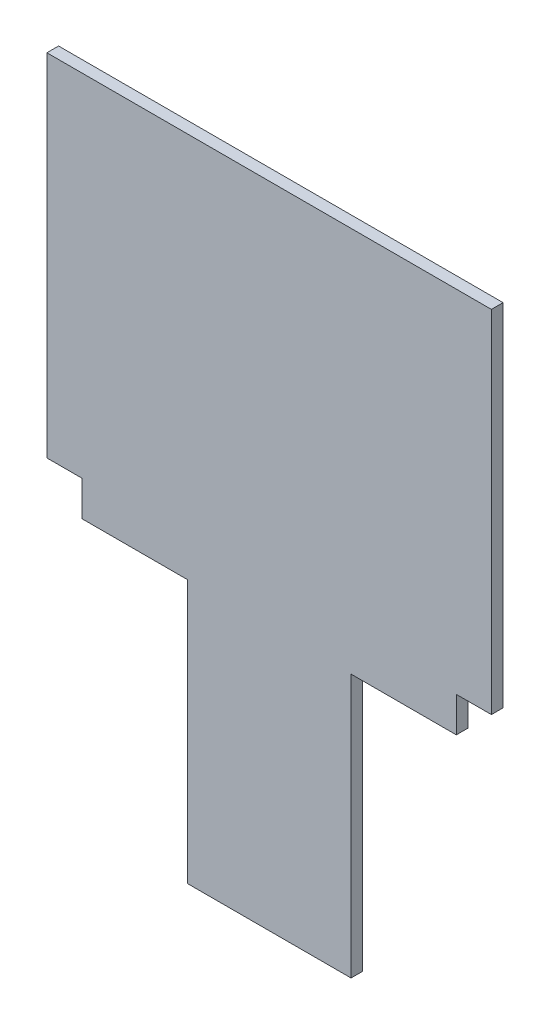
ISO-10303-21;
HEADER;
FILE_DESCRIPTION(('STEP AP214'),'2;1');
FILE_NAME('part.step','',(''),(''),'','','');
FILE_SCHEMA(('AUTOMOTIVE_DESIGN { 1 0 10303 214 1 1 1 1 }'));
ENDSEC;
DATA;
#1=APPLICATION_CONTEXT('core data for automotive mechanical design processes');
#2=APPLICATION_PROTOCOL_DEFINITION('international standard','automotive_design',2000,#1);
#3=PRODUCT_CONTEXT('',#1,'mechanical');
#4=PRODUCT('Part','Part','',(#3));
#5=PRODUCT_RELATED_PRODUCT_CATEGORY('part','',(#4));
#6=PRODUCT_DEFINITION_FORMATION('','',#4);
#7=PRODUCT_DEFINITION_CONTEXT('part definition',#1,'design');
#8=PRODUCT_DEFINITION('design','',#6,#7);
#9=PRODUCT_DEFINITION_SHAPE('','',#8);
#10=(LENGTH_UNIT() NAMED_UNIT(*) SI_UNIT(.MILLI.,.METRE.));
#11=(NAMED_UNIT(*) PLANE_ANGLE_UNIT() SI_UNIT($,.RADIAN.));
#12=(NAMED_UNIT(*) SI_UNIT($,.STERADIAN.) SOLID_ANGLE_UNIT());
#13=UNCERTAINTY_MEASURE_WITH_UNIT(LENGTH_MEASURE(1.E-05),#10,'distance_accuracy_value','');
#14=(GEOMETRIC_REPRESENTATION_CONTEXT(3) GLOBAL_UNCERTAINTY_ASSIGNED_CONTEXT((#13)) GLOBAL_UNIT_ASSIGNED_CONTEXT((#10,
#11,#12)) REPRESENTATION_CONTEXT('',''));
#15=CARTESIAN_POINT('',(0.,0.,0.));
#16=DIRECTION('',(0.,0.,1.));
#17=DIRECTION('',(1.,0.,0.));
#18=AXIS2_PLACEMENT_3D('',#15,#16,#17);
#19=CARTESIAN_POINT('',(14.,-113.,-2.));
#20=DIRECTION('',(0.,-1.,0.));
#21=DIRECTION('',(0.,0.,-1.));
#22=AXIS2_PLACEMENT_3D('',#19,#20,#21);
#23=PLANE('',#22);
#24=DIRECTION('',(1.,0.,0.));
#25=VECTOR('',#24,1.);
#26=CARTESIAN_POINT('',(14.,-113.,0.));
#27=LINE('',#26,#25);
#28=CARTESIAN_POINT('',(-14.,-113.,0.));
#29=VERTEX_POINT('',#28);
#30=CARTESIAN_POINT('',(14.,-113.,0.));
#31=VERTEX_POINT('',#30);
#32=EDGE_CURVE('E156',#29,#31,#27,.T.);
#33=ORIENTED_EDGE('',*,*,#32,.F.);
#34=DIRECTION('',(0.,0.,1.));
#35=VECTOR('',#34,1.);
#36=CARTESIAN_POINT('',(-14.,-113.,-2.));
#37=LINE('',#36,#35);
#38=CARTESIAN_POINT('',(-14.,-113.,-2.));
#39=VERTEX_POINT('',#38);
#40=EDGE_CURVE('E11',#39,#29,#37,.T.);
#41=ORIENTED_EDGE('',*,*,#40,.F.);
#42=DIRECTION('',(1.,0.,0.));
#43=VECTOR('',#42,1.);
#44=CARTESIAN_POINT('',(14.,-113.,-2.));
#45=LINE('',#44,#43);
#46=CARTESIAN_POINT('',(14.,-113.,-2.));
#47=VERTEX_POINT('',#46);
#48=EDGE_CURVE('E188',#39,#47,#45,.T.);
#49=ORIENTED_EDGE('',*,*,#48,.T.);
#50=DIRECTION('',(0.,0.,1.));
#51=VECTOR('',#50,1.);
#52=CARTESIAN_POINT('',(14.,-113.,-2.));
#53=LINE('',#52,#51);
#54=EDGE_CURVE('E38',#47,#31,#53,.T.);
#55=ORIENTED_EDGE('',*,*,#54,.T.);
#56=EDGE_LOOP('',(#33,#41,#49,#55));
#57=FACE_BOUND('',#56,.T.);
#58=ADVANCED_FACE('F35',(#57),#23,.T.);
#59=CARTESIAN_POINT('',(-14.,-68.,-2.));
#60=DIRECTION('',(-1.,0.,0.));
#61=DIRECTION('',(0.,0.,1.));
#62=AXIS2_PLACEMENT_3D('',#59,#60,#61);
#63=PLANE('',#62);
#64=DIRECTION('',(0.,-1.,0.));
#65=VECTOR('',#64,1.);
#66=CARTESIAN_POINT('',(-14.,-68.,0.));
#67=LINE('',#66,#65);
#68=CARTESIAN_POINT('',(-14.,-68.,0.));
#69=VERTEX_POINT('',#68);
#70=EDGE_CURVE('E186',#69,#29,#67,.T.);
#71=ORIENTED_EDGE('',*,*,#70,.F.);
#72=DIRECTION('',(0.,0.,1.));
#73=VECTOR('',#72,1.);
#74=CARTESIAN_POINT('',(-14.,-68.,-2.));
#75=LINE('',#74,#73);
#76=CARTESIAN_POINT('',(-14.,-68.,-2.));
#77=VERTEX_POINT('',#76);
#78=EDGE_CURVE('E44',#77,#69,#75,.T.);
#79=ORIENTED_EDGE('',*,*,#78,.F.);
#80=DIRECTION('',(0.,-1.,0.));
#81=VECTOR('',#80,1.);
#82=CARTESIAN_POINT('',(-14.,-68.,-2.));
#83=LINE('',#82,#81);
#84=EDGE_CURVE('E146',#77,#39,#83,.T.);
#85=ORIENTED_EDGE('',*,*,#84,.T.);
#86=ORIENTED_EDGE('',*,*,#40,.T.);
#87=EDGE_LOOP('',(#71,#79,#85,#86));
#88=FACE_BOUND('',#87,.T.);
#89=ADVANCED_FACE('F208',(#88),#63,.T.);
#90=CARTESIAN_POINT('',(-32.,-68.,-2.));
#91=DIRECTION('',(0.,-1.,0.));
#92=DIRECTION('',(0.,0.,-1.));
#93=AXIS2_PLACEMENT_3D('',#90,#91,#92);
#94=PLANE('',#93);
#95=DIRECTION('',(1.,0.,0.));
#96=VECTOR('',#95,1.);
#97=CARTESIAN_POINT('',(-32.,-68.,0.));
#98=LINE('',#97,#96);
#99=CARTESIAN_POINT('',(-32.,-68.,0.));
#100=VERTEX_POINT('',#99);
#101=EDGE_CURVE('E133',#100,#69,#98,.T.);
#102=ORIENTED_EDGE('',*,*,#101,.F.);
#103=DIRECTION('',(0.,0.,1.));
#104=VECTOR('',#103,1.);
#105=CARTESIAN_POINT('',(-32.,-68.,-2.));
#106=LINE('',#105,#104);
#107=CARTESIAN_POINT('',(-32.,-68.,-2.));
#108=VERTEX_POINT('',#107);
#109=EDGE_CURVE('E128',#108,#100,#106,.T.);
#110=ORIENTED_EDGE('',*,*,#109,.F.);
#111=DIRECTION('',(1.,0.,0.));
#112=VECTOR('',#111,1.);
#113=CARTESIAN_POINT('',(-32.,-68.,-2.));
#114=LINE('',#113,#112);
#115=EDGE_CURVE('E131',#108,#77,#114,.T.);
#116=ORIENTED_EDGE('',*,*,#115,.T.);
#117=ORIENTED_EDGE('',*,*,#78,.T.);
#118=EDGE_LOOP('',(#102,#110,#116,#117));
#119=FACE_BOUND('',#118,.T.);
#120=ADVANCED_FACE('F130',(#119),#94,.T.);
#121=CARTESIAN_POINT('',(-32.,-68.,-2.));
#122=DIRECTION('',(-1.,0.,0.));
#123=DIRECTION('',(0.,0.,1.));
#124=AXIS2_PLACEMENT_3D('',#121,#122,#123);
#125=PLANE('',#124);
#126=DIRECTION('',(0.,-1.,0.));
#127=VECTOR('',#126,1.);
#128=CARTESIAN_POINT('',(-32.,-68.,0.));
#129=LINE('',#128,#127);
#130=CARTESIAN_POINT('',(-32.,-62.,0.));
#131=VERTEX_POINT('',#130);
#132=EDGE_CURVE('E183',#131,#100,#129,.T.);
#133=ORIENTED_EDGE('',*,*,#132,.F.);
#134=DIRECTION('',(0.,0.,1.));
#135=VECTOR('',#134,1.);
#136=CARTESIAN_POINT('',(-32.,-62.,-2.));
#137=LINE('',#136,#135);
#138=CARTESIAN_POINT('',(-32.,-62.,-2.));
#139=VERTEX_POINT('',#138);
#140=EDGE_CURVE('E138',#139,#131,#137,.T.);
#141=ORIENTED_EDGE('',*,*,#140,.F.);
#142=DIRECTION('',(0.,-1.,0.));
#143=VECTOR('',#142,1.);
#144=CARTESIAN_POINT('',(-32.,-68.,-2.));
#145=LINE('',#144,#143);
#146=EDGE_CURVE('E144',#139,#108,#145,.T.);
#147=ORIENTED_EDGE('',*,*,#146,.T.);
#148=ORIENTED_EDGE('',*,*,#109,.T.);
#149=EDGE_LOOP('',(#133,#141,#147,#148));
#150=FACE_BOUND('',#149,.T.);
#151=ADVANCED_FACE('F148',(#150),#125,.T.);
#152=CARTESIAN_POINT('',(-32.,-62.,-2.));
#153=DIRECTION('',(0.,-1.,0.));
#154=DIRECTION('',(0.,0.,-1.));
#155=AXIS2_PLACEMENT_3D('',#152,#153,#154);
#156=PLANE('',#155);
#157=DIRECTION('',(1.,0.,0.));
#158=VECTOR('',#157,1.);
#159=CARTESIAN_POINT('',(-32.,-62.,0.));
#160=LINE('',#159,#158);
#161=CARTESIAN_POINT('',(-38.,-62.,0.));
#162=VERTEX_POINT('',#161);
#163=EDGE_CURVE('E180',#162,#131,#160,.T.);
#164=ORIENTED_EDGE('',*,*,#163,.F.);
#165=DIRECTION('',(0.,0.,1.));
#166=VECTOR('',#165,1.);
#167=CARTESIAN_POINT('',(-38.,-62.,-2.));
#168=LINE('',#167,#166);
#169=CARTESIAN_POINT('',(-38.,-62.,-2.));
#170=VERTEX_POINT('',#169);
#171=EDGE_CURVE('E192',#170,#162,#168,.T.);
#172=ORIENTED_EDGE('',*,*,#171,.F.);
#173=DIRECTION('',(1.,0.,0.));
#174=VECTOR('',#173,1.);
#175=CARTESIAN_POINT('',(-32.,-62.,-2.));
#176=LINE('',#175,#174);
#177=EDGE_CURVE('E149',#170,#139,#176,.T.);
#178=ORIENTED_EDGE('',*,*,#177,.T.);
#179=ORIENTED_EDGE('',*,*,#140,.T.);
#180=EDGE_LOOP('',(#164,#172,#178,#179));
#181=FACE_BOUND('',#180,.T.);
#182=ADVANCED_FACE('F221',(#181),#156,.T.);
#183=CARTESIAN_POINT('',(-38.,-2.,-2.));
#184=DIRECTION('',(-1.,0.,0.));
#185=DIRECTION('',(0.,0.,1.));
#186=AXIS2_PLACEMENT_3D('',#183,#184,#185);
#187=PLANE('',#186);
#188=DIRECTION('',(0.,-1.,0.));
#189=VECTOR('',#188,1.);
#190=CARTESIAN_POINT('',(-38.,-2.,0.));
#191=LINE('',#190,#189);
#192=CARTESIAN_POINT('',(-38.,-2.,0.));
#193=VERTEX_POINT('',#192);
#194=EDGE_CURVE('E177',#193,#162,#191,.T.);
#195=ORIENTED_EDGE('',*,*,#194,.F.);
#196=DIRECTION('',(0.,0.,1.));
#197=VECTOR('',#196,1.);
#198=CARTESIAN_POINT('',(-38.,-2.,-2.));
#199=LINE('',#198,#197);
#200=CARTESIAN_POINT('',(-38.,-2.,-2.));
#201=VERTEX_POINT('',#200);
#202=EDGE_CURVE('E194',#201,#193,#199,.T.);
#203=ORIENTED_EDGE('',*,*,#202,.F.);
#204=DIRECTION('',(0.,-1.,0.));
#205=VECTOR('',#204,1.);
#206=CARTESIAN_POINT('',(-38.,-2.,-2.));
#207=LINE('',#206,#205);
#208=EDGE_CURVE('E151',#201,#170,#207,.T.);
#209=ORIENTED_EDGE('',*,*,#208,.T.);
#210=ORIENTED_EDGE('',*,*,#171,.T.);
#211=EDGE_LOOP('',(#195,#203,#209,#210));
#212=FACE_BOUND('',#211,.T.);
#213=ADVANCED_FACE('F224',(#212),#187,.T.);
#214=CARTESIAN_POINT('',(38.,-2.,-2.));
#215=DIRECTION('',(0.,1.,0.));
#216=DIRECTION('',(0.,0.,1.));
#217=AXIS2_PLACEMENT_3D('',#214,#215,#216);
#218=PLANE('',#217);
#219=DIRECTION('',(-1.,0.,0.));
#220=VECTOR('',#219,1.);
#221=CARTESIAN_POINT('',(38.,-2.,0.));
#222=LINE('',#221,#220);
#223=CARTESIAN_POINT('',(38.,-2.,0.));
#224=VERTEX_POINT('',#223);
#225=EDGE_CURVE('E174',#224,#193,#222,.T.);
#226=ORIENTED_EDGE('',*,*,#225,.F.);
#227=DIRECTION('',(0.,0.,1.));
#228=VECTOR('',#227,1.);
#229=CARTESIAN_POINT('',(38.,-2.,-2.));
#230=LINE('',#229,#228);
#231=CARTESIAN_POINT('',(38.,-2.,-2.));
#232=VERTEX_POINT('',#231);
#233=EDGE_CURVE('E196',#232,#224,#230,.T.);
#234=ORIENTED_EDGE('',*,*,#233,.F.);
#235=DIRECTION('',(-1.,0.,0.));
#236=VECTOR('',#235,1.);
#237=CARTESIAN_POINT('',(38.,-2.,-2.));
#238=LINE('',#237,#236);
#239=EDGE_CURVE('E350',#232,#201,#238,.T.);
#240=ORIENTED_EDGE('',*,*,#239,.T.);
#241=ORIENTED_EDGE('',*,*,#202,.T.);
#242=EDGE_LOOP('',(#226,#234,#240,#241));
#243=FACE_BOUND('',#242,.T.);
#244=ADVANCED_FACE('F228',(#243),#218,.T.);
#245=CARTESIAN_POINT('',(38.,-62.,-2.));
#246=DIRECTION('',(1.,0.,0.));
#247=DIRECTION('',(0.,0.,-1.));
#248=AXIS2_PLACEMENT_3D('',#245,#246,#247);
#249=PLANE('',#248);
#250=DIRECTION('',(0.,1.,0.));
#251=VECTOR('',#250,1.);
#252=CARTESIAN_POINT('',(38.,-62.,0.));
#253=LINE('',#252,#251);
#254=CARTESIAN_POINT('',(38.,-62.,0.));
#255=VERTEX_POINT('',#254);
#256=EDGE_CURVE('E171',#255,#224,#253,.T.);
#257=ORIENTED_EDGE('',*,*,#256,.F.);
#258=DIRECTION('',(0.,0.,1.));
#259=VECTOR('',#258,1.);
#260=CARTESIAN_POINT('',(38.,-62.,-2.));
#261=LINE('',#260,#259);
#262=CARTESIAN_POINT('',(38.,-62.,-2.));
#263=VERTEX_POINT('',#262);
#264=EDGE_CURVE('E198',#263,#255,#261,.T.);
#265=ORIENTED_EDGE('',*,*,#264,.F.);
#266=DIRECTION('',(0.,1.,0.));
#267=VECTOR('',#266,1.);
#268=CARTESIAN_POINT('',(38.,-62.,-2.));
#269=LINE('',#268,#267);
#270=EDGE_CURVE('E354',#263,#232,#269,.T.);
#271=ORIENTED_EDGE('',*,*,#270,.T.);
#272=ORIENTED_EDGE('',*,*,#233,.T.);
#273=EDGE_LOOP('',(#257,#265,#271,#272));
#274=FACE_BOUND('',#273,.T.);
#275=ADVANCED_FACE('F232',(#274),#249,.T.);
#276=CARTESIAN_POINT('',(38.,-62.,-2.));
#277=DIRECTION('',(0.,-1.,0.));
#278=DIRECTION('',(0.,0.,-1.));
#279=AXIS2_PLACEMENT_3D('',#276,#277,#278);
#280=PLANE('',#279);
#281=DIRECTION('',(1.,0.,0.));
#282=VECTOR('',#281,1.);
#283=CARTESIAN_POINT('',(38.,-62.,0.));
#284=LINE('',#283,#282);
#285=CARTESIAN_POINT('',(32.,-62.,0.));
#286=VERTEX_POINT('',#285);
#287=EDGE_CURVE('E168',#286,#255,#284,.T.);
#288=ORIENTED_EDGE('',*,*,#287,.F.);
#289=DIRECTION('',(0.,0.,1.));
#290=VECTOR('',#289,1.);
#291=CARTESIAN_POINT('',(32.,-62.,-2.));
#292=LINE('',#291,#290);
#293=CARTESIAN_POINT('',(32.,-62.,-2.));
#294=VERTEX_POINT('',#293);
#295=EDGE_CURVE('E200',#294,#286,#292,.T.);
#296=ORIENTED_EDGE('',*,*,#295,.F.);
#297=DIRECTION('',(1.,0.,0.));
#298=VECTOR('',#297,1.);
#299=CARTESIAN_POINT('',(38.,-62.,-2.));
#300=LINE('',#299,#298);
#301=EDGE_CURVE('E343',#294,#263,#300,.T.);
#302=ORIENTED_EDGE('',*,*,#301,.T.);
#303=ORIENTED_EDGE('',*,*,#264,.T.);
#304=EDGE_LOOP('',(#288,#296,#302,#303));
#305=FACE_BOUND('',#304,.T.);
#306=ADVANCED_FACE('F236',(#305),#280,.T.);
#307=CARTESIAN_POINT('',(32.,-62.,-2.));
#308=DIRECTION('',(1.,0.,0.));
#309=DIRECTION('',(0.,0.,-1.));
#310=AXIS2_PLACEMENT_3D('',#307,#308,#309);
#311=PLANE('',#310);
#312=DIRECTION('',(0.,1.,0.));
#313=VECTOR('',#312,1.);
#314=CARTESIAN_POINT('',(32.,-62.,0.));
#315=LINE('',#314,#313);
#316=CARTESIAN_POINT('',(32.,-68.,0.));
#317=VERTEX_POINT('',#316);
#318=EDGE_CURVE('E165',#317,#286,#315,.T.);
#319=ORIENTED_EDGE('',*,*,#318,.F.);
#320=DIRECTION('',(0.,0.,1.));
#321=VECTOR('',#320,1.);
#322=CARTESIAN_POINT('',(32.,-68.,-2.));
#323=LINE('',#322,#321);
#324=CARTESIAN_POINT('',(32.,-68.,-2.));
#325=VERTEX_POINT('',#324);
#326=EDGE_CURVE('E202',#325,#317,#323,.T.);
#327=ORIENTED_EDGE('',*,*,#326,.F.);
#328=DIRECTION('',(0.,1.,0.));
#329=VECTOR('',#328,1.);
#330=CARTESIAN_POINT('',(32.,-62.,-2.));
#331=LINE('',#330,#329);
#332=EDGE_CURVE('E339',#325,#294,#331,.T.);
#333=ORIENTED_EDGE('',*,*,#332,.T.);
#334=ORIENTED_EDGE('',*,*,#295,.T.);
#335=EDGE_LOOP('',(#319,#327,#333,#334));
#336=FACE_BOUND('',#335,.T.);
#337=ADVANCED_FACE('F240',(#336),#311,.T.);
#338=CARTESIAN_POINT('',(14.,-68.,-2.));
#339=DIRECTION('',(0.,-1.,0.));
#340=DIRECTION('',(0.,0.,-1.));
#341=AXIS2_PLACEMENT_3D('',#338,#339,#340);
#342=PLANE('',#341);
#343=DIRECTION('',(1.,0.,0.));
#344=VECTOR('',#343,1.);
#345=CARTESIAN_POINT('',(14.,-68.,0.));
#346=LINE('',#345,#344);
#347=CARTESIAN_POINT('',(14.,-68.,0.));
#348=VERTEX_POINT('',#347);
#349=EDGE_CURVE('E162',#348,#317,#346,.T.);
#350=ORIENTED_EDGE('',*,*,#349,.F.);
#351=DIRECTION('',(0.,0.,1.));
#352=VECTOR('',#351,1.);
#353=CARTESIAN_POINT('',(14.,-68.,-2.));
#354=LINE('',#353,#352);
#355=CARTESIAN_POINT('',(14.,-68.,-2.));
#356=VERTEX_POINT('',#355);
#357=EDGE_CURVE('E203',#356,#348,#354,.T.);
#358=ORIENTED_EDGE('',*,*,#357,.F.);
#359=DIRECTION('',(1.,0.,0.));
#360=VECTOR('',#359,1.);
#361=CARTESIAN_POINT('',(14.,-68.,-2.));
#362=LINE('',#361,#360);
#363=EDGE_CURVE('E360',#356,#325,#362,.T.);
#364=ORIENTED_EDGE('',*,*,#363,.T.);
#365=ORIENTED_EDGE('',*,*,#326,.T.);
#366=EDGE_LOOP('',(#350,#358,#364,#365));
#367=FACE_BOUND('',#366,.T.);
#368=ADVANCED_FACE('F244',(#367),#342,.T.);
#369=CARTESIAN_POINT('',(14.,-113.,-2.));
#370=DIRECTION('',(1.,0.,0.));
#371=DIRECTION('',(0.,1.,0.));
#372=AXIS2_PLACEMENT_3D('',#369,#370,#371);
#373=PLANE('',#372);
#374=DIRECTION('',(0.,1.,0.));
#375=VECTOR('',#374,1.);
#376=CARTESIAN_POINT('',(14.,-113.,0.));
#377=LINE('',#376,#375);
#378=EDGE_CURVE('E159',#31,#348,#377,.T.);
#379=ORIENTED_EDGE('',*,*,#378,.F.);
#380=ORIENTED_EDGE('',*,*,#54,.F.);
#381=DIRECTION('',(0.,1.,0.));
#382=VECTOR('',#381,1.);
#383=CARTESIAN_POINT('',(14.,-113.,-2.));
#384=LINE('',#383,#382);
#385=EDGE_CURVE('E362',#47,#356,#384,.T.);
#386=ORIENTED_EDGE('',*,*,#385,.T.);
#387=ORIENTED_EDGE('',*,*,#357,.T.);
#388=EDGE_LOOP('',(#379,#380,#386,#387));
#389=FACE_BOUND('',#388,.T.);
#390=ADVANCED_FACE('F205',(#389),#373,.T.);
#391=CARTESIAN_POINT('',(0.,0.,-2.));
#392=DIRECTION('',(0.,0.,1.));
#393=DIRECTION('',(1.,0.,0.));
#394=AXIS2_PLACEMENT_3D('',#391,#392,#393);
#395=PLANE('',#394);
#396=ORIENTED_EDGE('',*,*,#48,.F.);
#397=ORIENTED_EDGE('',*,*,#84,.F.);
#398=ORIENTED_EDGE('',*,*,#115,.F.);
#399=ORIENTED_EDGE('',*,*,#146,.F.);
#400=ORIENTED_EDGE('',*,*,#177,.F.);
#401=ORIENTED_EDGE('',*,*,#208,.F.);
#402=ORIENTED_EDGE('',*,*,#239,.F.);
#403=ORIENTED_EDGE('',*,*,#270,.F.);
#404=ORIENTED_EDGE('',*,*,#301,.F.);
#405=ORIENTED_EDGE('',*,*,#332,.F.);
#406=ORIENTED_EDGE('',*,*,#363,.F.);
#407=ORIENTED_EDGE('',*,*,#385,.F.);
#408=EDGE_LOOP('',(#396,#397,#398,#399,#400,#401,#402,#403,#404,#405,#406,#407));
#409=FACE_BOUND('',#408,.T.);
#410=ADVANCED_FACE('F142',(#409),#395,.F.);
#411=CARTESIAN_POINT('',(0.,0.,0.));
#412=DIRECTION('',(0.,0.,1.));
#413=DIRECTION('',(1.,0.,0.));
#414=AXIS2_PLACEMENT_3D('',#411,#412,#413);
#415=PLANE('',#414);
#416=ORIENTED_EDGE('',*,*,#32,.T.);
#417=ORIENTED_EDGE('',*,*,#378,.T.);
#418=ORIENTED_EDGE('',*,*,#349,.T.);
#419=ORIENTED_EDGE('',*,*,#318,.T.);
#420=ORIENTED_EDGE('',*,*,#287,.T.);
#421=ORIENTED_EDGE('',*,*,#256,.T.);
#422=ORIENTED_EDGE('',*,*,#225,.T.);
#423=ORIENTED_EDGE('',*,*,#194,.T.);
#424=ORIENTED_EDGE('',*,*,#163,.T.);
#425=ORIENTED_EDGE('',*,*,#132,.T.);
#426=ORIENTED_EDGE('',*,*,#101,.T.);
#427=ORIENTED_EDGE('',*,*,#70,.T.);
#428=EDGE_LOOP('',(#416,#417,#418,#419,#420,#421,#422,#423,#424,#425,#426,#427));
#429=FACE_BOUND('',#428,.T.);
#430=ADVANCED_FACE('F207',(#429),#415,.T.);
#431=CLOSED_SHELL('',(#58,#89,#120,#151,#182,#213,#244,#275,#306,#337,#368,#390,#410,#430));
#432=MANIFOLD_SOLID_BREP('B2',#431);
#433=ADVANCED_BREP_SHAPE_REPRESENTATION('',(#18,#432),#14);
#434=SHAPE_DEFINITION_REPRESENTATION(#9,#433);
ENDSEC;
END-ISO-10303-21;
